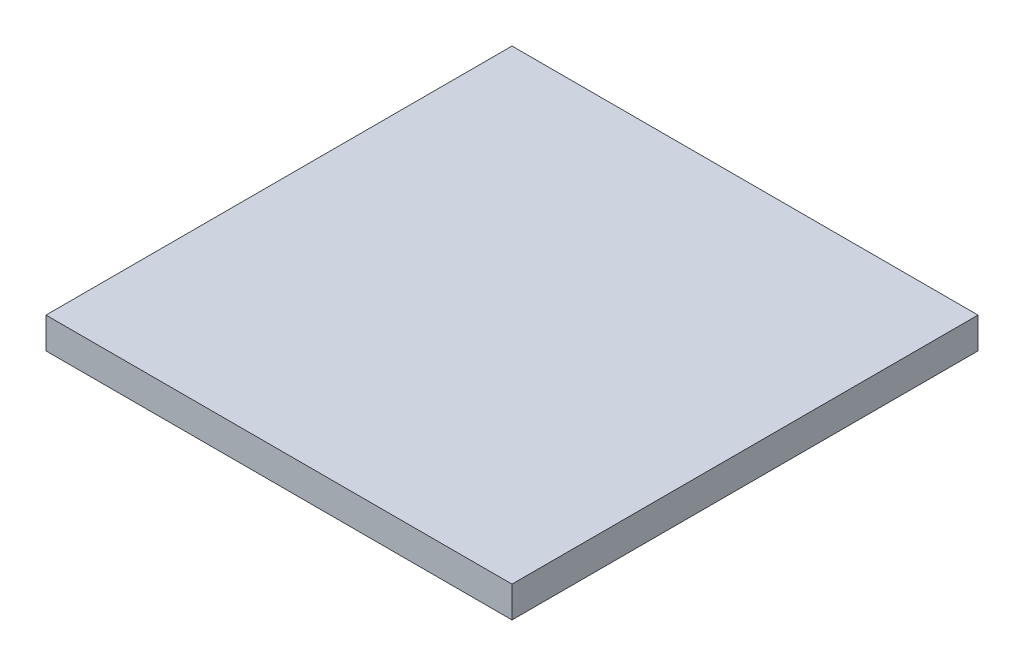
ISO-10303-21;
HEADER;
FILE_DESCRIPTION(('STEP AP214'),'2;1');
FILE_NAME('part.step','',(''),(''),'','','');
FILE_SCHEMA(('AUTOMOTIVE_DESIGN { 1 0 10303 214 1 1 1 1 }'));
ENDSEC;
DATA;
#1=APPLICATION_CONTEXT('core data for automotive mechanical design processes');
#2=APPLICATION_PROTOCOL_DEFINITION('international standard','automotive_design',2000,#1);
#3=PRODUCT_CONTEXT('',#1,'mechanical');
#4=PRODUCT('Part','Part','',(#3));
#5=PRODUCT_RELATED_PRODUCT_CATEGORY('part','',(#4));
#6=PRODUCT_DEFINITION_FORMATION('','',#4);
#7=PRODUCT_DEFINITION_CONTEXT('part definition',#1,'design');
#8=PRODUCT_DEFINITION('design','',#6,#7);
#9=PRODUCT_DEFINITION_SHAPE('','',#8);
#10=(LENGTH_UNIT() NAMED_UNIT(*) SI_UNIT(.MILLI.,.METRE.));
#11=(NAMED_UNIT(*) PLANE_ANGLE_UNIT() SI_UNIT($,.RADIAN.));
#12=(NAMED_UNIT(*) SI_UNIT($,.STERADIAN.) SOLID_ANGLE_UNIT());
#13=UNCERTAINTY_MEASURE_WITH_UNIT(LENGTH_MEASURE(1.E-05),#10,'distance_accuracy_value','');
#14=(GEOMETRIC_REPRESENTATION_CONTEXT(3) GLOBAL_UNCERTAINTY_ASSIGNED_CONTEXT((#13)) GLOBAL_UNIT_ASSIGNED_CONTEXT((#10,
#11,#12)) REPRESENTATION_CONTEXT('',''));
#15=CARTESIAN_POINT('',(0.,0.,0.));
#16=DIRECTION('',(0.,0.,1.));
#17=DIRECTION('',(1.,0.,0.));
#18=AXIS2_PLACEMENT_3D('',#15,#16,#17);
#19=CARTESIAN_POINT('',(7.5,1.,-7.5));
#20=DIRECTION('',(-1.,0.,0.));
#21=DIRECTION('',(0.,0.,1.));
#22=AXIS2_PLACEMENT_3D('',#19,#20,#21);
#23=PLANE('',#22);
#24=DIRECTION('',(0.,0.,-1.));
#25=VECTOR('',#24,1.);
#26=CARTESIAN_POINT('',(7.5,0.,-7.5));
#27=LINE('',#26,#25);
#28=CARTESIAN_POINT('',(7.5,0.,7.5));
#29=VERTEX_POINT('',#28);
#30=CARTESIAN_POINT('',(7.5,0.,-7.5));
#31=VERTEX_POINT('',#30);
#32=EDGE_CURVE('E95',#29,#31,#27,.T.);
#33=ORIENTED_EDGE('',*,*,#32,.T.);
#34=DIRECTION('',(0.,-1.,0.));
#35=VECTOR('',#34,1.);
#36=CARTESIAN_POINT('',(7.5,1.,-7.5));
#37=LINE('',#36,#35);
#38=CARTESIAN_POINT('',(7.5,1.,-7.5));
#39=VERTEX_POINT('',#38);
#40=EDGE_CURVE('E11',#39,#31,#37,.T.);
#41=ORIENTED_EDGE('',*,*,#40,.F.);
#42=DIRECTION('',(0.,0.,-1.));
#43=VECTOR('',#42,1.);
#44=CARTESIAN_POINT('',(7.5,1.,-7.5));
#45=LINE('',#44,#43);
#46=CARTESIAN_POINT('',(7.5,1.,7.5));
#47=VERTEX_POINT('',#46);
#48=EDGE_CURVE('E83',#47,#39,#45,.T.);
#49=ORIENTED_EDGE('',*,*,#48,.F.);
#50=DIRECTION('',(0.,-1.,0.));
#51=VECTOR('',#50,1.);
#52=CARTESIAN_POINT('',(7.5,1.,7.5));
#53=LINE('',#52,#51);
#54=EDGE_CURVE('E91',#47,#29,#53,.T.);
#55=ORIENTED_EDGE('',*,*,#54,.T.);
#56=EDGE_LOOP('',(#33,#41,#49,#55));
#57=FACE_BOUND('',#56,.T.);
#58=ADVANCED_FACE('F32',(#57),#23,.F.);
#59=CARTESIAN_POINT('',(-7.5,1.,-7.5));
#60=DIRECTION('',(0.,0.,1.));
#61=DIRECTION('',(1.,0.,0.));
#62=AXIS2_PLACEMENT_3D('',#59,#60,#61);
#63=PLANE('',#62);
#64=DIRECTION('',(-1.,0.,0.));
#65=VECTOR('',#64,1.);
#66=CARTESIAN_POINT('',(-7.5,0.,-7.5));
#67=LINE('',#66,#65);
#68=CARTESIAN_POINT('',(-7.5,0.,-7.5));
#69=VERTEX_POINT('',#68);
#70=EDGE_CURVE('E87',#31,#69,#67,.T.);
#71=ORIENTED_EDGE('',*,*,#70,.T.);
#72=DIRECTION('',(0.,-1.,0.));
#73=VECTOR('',#72,1.);
#74=CARTESIAN_POINT('',(-7.5,1.,-7.5));
#75=LINE('',#74,#73);
#76=CARTESIAN_POINT('',(-7.5,1.,-7.5));
#77=VERTEX_POINT('',#76);
#78=EDGE_CURVE('E40',#77,#69,#75,.T.);
#79=ORIENTED_EDGE('',*,*,#78,.F.);
#80=DIRECTION('',(-1.,0.,0.));
#81=VECTOR('',#80,1.);
#82=CARTESIAN_POINT('',(-7.5,1.,-7.5));
#83=LINE('',#82,#81);
#84=EDGE_CURVE('E78',#39,#77,#83,.T.);
#85=ORIENTED_EDGE('',*,*,#84,.F.);
#86=ORIENTED_EDGE('',*,*,#40,.T.);
#87=EDGE_LOOP('',(#71,#79,#85,#86));
#88=FACE_BOUND('',#87,.T.);
#89=ADVANCED_FACE('F86',(#88),#63,.F.);
#90=CARTESIAN_POINT('',(-7.5,1.,-7.5));
#91=DIRECTION('',(1.,0.,0.));
#92=DIRECTION('',(0.,0.,-1.));
#93=AXIS2_PLACEMENT_3D('',#90,#91,#92);
#94=PLANE('',#93);
#95=DIRECTION('',(0.,0.,1.));
#96=VECTOR('',#95,1.);
#97=CARTESIAN_POINT('',(-7.5,0.,-7.5));
#98=LINE('',#97,#96);
#99=CARTESIAN_POINT('',(-7.5,0.,7.5));
#100=VERTEX_POINT('',#99);
#101=EDGE_CURVE('E65',#69,#100,#98,.T.);
#102=ORIENTED_EDGE('',*,*,#101,.T.);
#103=DIRECTION('',(0.,-1.,0.));
#104=VECTOR('',#103,1.);
#105=CARTESIAN_POINT('',(-7.5,1.,7.5));
#106=LINE('',#105,#104);
#107=CARTESIAN_POINT('',(-7.5,1.,7.5));
#108=VERTEX_POINT('',#107);
#109=EDGE_CURVE('E88',#108,#100,#106,.T.);
#110=ORIENTED_EDGE('',*,*,#109,.F.);
#111=DIRECTION('',(0.,0.,1.));
#112=VECTOR('',#111,1.);
#113=CARTESIAN_POINT('',(-7.5,1.,-7.5));
#114=LINE('',#113,#112);
#115=EDGE_CURVE('E81',#77,#108,#114,.T.);
#116=ORIENTED_EDGE('',*,*,#115,.F.);
#117=ORIENTED_EDGE('',*,*,#78,.T.);
#118=EDGE_LOOP('',(#102,#110,#116,#117));
#119=FACE_BOUND('',#118,.T.);
#120=ADVANCED_FACE('F89',(#119),#94,.F.);
#121=CARTESIAN_POINT('',(-7.5,1.,7.5));
#122=DIRECTION('',(0.,0.,-1.));
#123=DIRECTION('',(-1.,0.,0.));
#124=AXIS2_PLACEMENT_3D('',#121,#122,#123);
#125=PLANE('',#124);
#126=DIRECTION('',(1.,0.,0.));
#127=VECTOR('',#126,1.);
#128=CARTESIAN_POINT('',(-7.5,0.,7.5));
#129=LINE('',#128,#127);
#130=EDGE_CURVE('E71',#100,#29,#129,.T.);
#131=ORIENTED_EDGE('',*,*,#130,.T.);
#132=ORIENTED_EDGE('',*,*,#54,.F.);
#133=DIRECTION('',(1.,0.,0.));
#134=VECTOR('',#133,1.);
#135=CARTESIAN_POINT('',(-7.5,1.,7.5));
#136=LINE('',#135,#134);
#137=EDGE_CURVE('E48',#108,#47,#136,.T.);
#138=ORIENTED_EDGE('',*,*,#137,.F.);
#139=ORIENTED_EDGE('',*,*,#109,.T.);
#140=EDGE_LOOP('',(#131,#132,#138,#139));
#141=FACE_BOUND('',#140,.T.);
#142=ADVANCED_FACE('F102',(#141),#125,.F.);
#143=CARTESIAN_POINT('',(0.,1.,0.));
#144=DIRECTION('',(0.,1.,0.));
#145=DIRECTION('',(0.,0.,1.));
#146=AXIS2_PLACEMENT_3D('',#143,#144,#145);
#147=PLANE('',#146);
#148=ORIENTED_EDGE('',*,*,#48,.T.);
#149=ORIENTED_EDGE('',*,*,#84,.T.);
#150=ORIENTED_EDGE('',*,*,#115,.T.);
#151=ORIENTED_EDGE('',*,*,#137,.T.);
#152=EDGE_LOOP('',(#148,#149,#150,#151));
#153=FACE_BOUND('',#152,.T.);
#154=ADVANCED_FACE('F79',(#153),#147,.T.);
#155=CARTESIAN_POINT('',(0.,0.,0.));
#156=DIRECTION('',(0.,1.,0.));
#157=DIRECTION('',(0.,0.,1.));
#158=AXIS2_PLACEMENT_3D('',#155,#156,#157);
#159=PLANE('',#158);
#160=ORIENTED_EDGE('',*,*,#32,.F.);
#161=ORIENTED_EDGE('',*,*,#130,.F.);
#162=ORIENTED_EDGE('',*,*,#101,.F.);
#163=ORIENTED_EDGE('',*,*,#70,.F.);
#164=EDGE_LOOP('',(#160,#161,#162,#163));
#165=FACE_BOUND('',#164,.T.);
#166=ADVANCED_FACE('F105',(#165),#159,.F.);
#167=CLOSED_SHELL('',(#58,#89,#120,#142,#154,#166));
#168=MANIFOLD_SOLID_BREP('B2',#167);
#169=ADVANCED_BREP_SHAPE_REPRESENTATION('',(#18,#168),#14);
#170=SHAPE_DEFINITION_REPRESENTATION(#9,#169);
ENDSEC;
END-ISO-10303-21;
